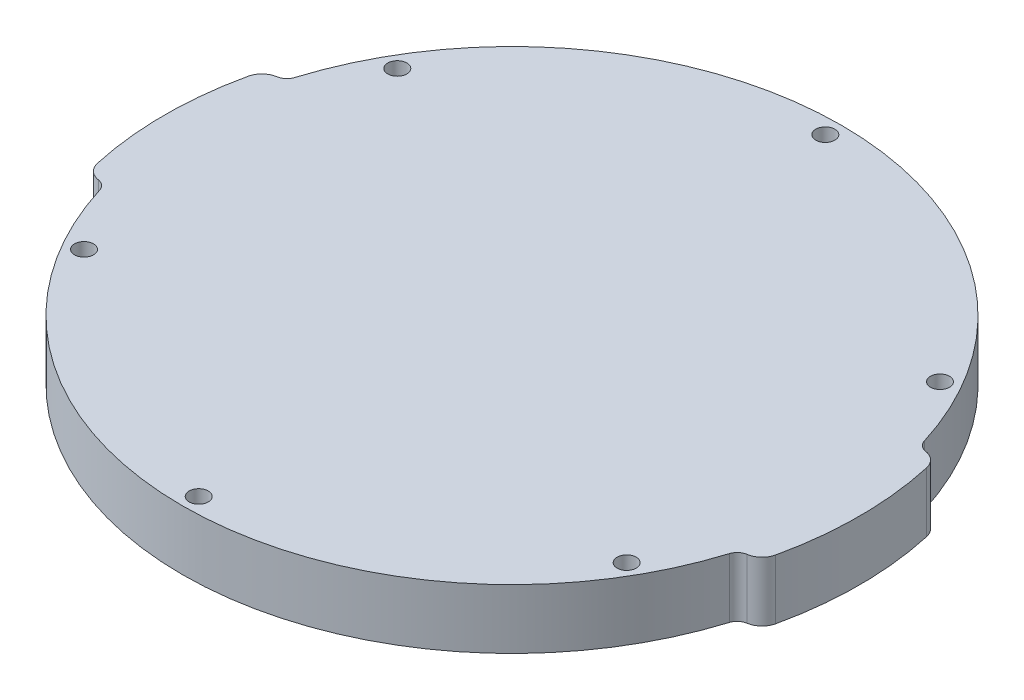
ISO-10303-21;
HEADER;
FILE_DESCRIPTION(('STEP AP214'),'2;1');
FILE_NAME('part.step','',(''),(''),'','','');
FILE_SCHEMA(('AUTOMOTIVE_DESIGN { 1 0 10303 214 1 1 1 1 }'));
ENDSEC;
DATA;
#1=APPLICATION_CONTEXT('core data for automotive mechanical design processes');
#2=APPLICATION_PROTOCOL_DEFINITION('international standard','automotive_design',2000,#1);
#3=PRODUCT_CONTEXT('',#1,'mechanical');
#4=PRODUCT('Part','Part','',(#3));
#5=PRODUCT_RELATED_PRODUCT_CATEGORY('part','',(#4));
#6=PRODUCT_DEFINITION_FORMATION('','',#4);
#7=PRODUCT_DEFINITION_CONTEXT('part definition',#1,'design');
#8=PRODUCT_DEFINITION('design','',#6,#7);
#9=PRODUCT_DEFINITION_SHAPE('','',#8);
#10=(LENGTH_UNIT() NAMED_UNIT(*) SI_UNIT(.MILLI.,.METRE.));
#11=(NAMED_UNIT(*) PLANE_ANGLE_UNIT() SI_UNIT($,.RADIAN.));
#12=(NAMED_UNIT(*) SI_UNIT($,.STERADIAN.) SOLID_ANGLE_UNIT());
#13=UNCERTAINTY_MEASURE_WITH_UNIT(LENGTH_MEASURE(1.E-05),#10,'distance_accuracy_value','');
#14=(GEOMETRIC_REPRESENTATION_CONTEXT(3) GLOBAL_UNCERTAINTY_ASSIGNED_CONTEXT((#13)) GLOBAL_UNIT_ASSIGNED_CONTEXT((#10,
#11,#12)) REPRESENTATION_CONTEXT('',''));
#15=CARTESIAN_POINT('',(0.,0.,0.));
#16=DIRECTION('',(0.,0.,1.));
#17=DIRECTION('',(1.,0.,0.));
#18=AXIS2_PLACEMENT_3D('',#15,#16,#17);
#19=CARTESIAN_POINT('',(0.,10.,0.));
#20=DIRECTION('',(0.,-1.,0.));
#21=DIRECTION('',(0.,0.,-1.));
#22=AXIS2_PLACEMENT_3D('',#19,#20,#21);
#23=CYLINDRICAL_SURFACE('',#22,55.25);
#24=CARTESIAN_POINT('',(0.,10.,0.));
#25=DIRECTION('',(0.,-1.,0.));
#26=DIRECTION('',(0.,0.,-1.));
#27=AXIS2_PLACEMENT_3D('',#24,#25,#26);
#28=CIRCLE('',#27,55.25);
#29=CARTESIAN_POINT('',(-52.7751034962949,10.,-16.3508700366483));
#30=VERTEX_POINT('',#29);
#31=CARTESIAN_POINT('',(52.7751034962949,10.,-16.3508700366483));
#32=VERTEX_POINT('',#31);
#33=EDGE_CURVE('E203',#30,#32,#28,.T.);
#34=ORIENTED_EDGE('',*,*,#33,.T.);
#35=DIRECTION('',(0.,-1.,0.));
#36=VECTOR('',#35,1.);
#37=CARTESIAN_POINT('',(52.7751034962949,10.,-16.3508700366483));
#38=LINE('',#37,#36);
#39=CARTESIAN_POINT('',(52.7751034962949,0.,-16.3508700366483));
#40=VERTEX_POINT('',#39);
#41=EDGE_CURVE('E168',#32,#40,#38,.T.);
#42=ORIENTED_EDGE('',*,*,#41,.T.);
#43=CARTESIAN_POINT('',(0.,0.,0.));
#44=DIRECTION('',(0.,1.,0.));
#45=DIRECTION('',(0.,0.,1.));
#46=AXIS2_PLACEMENT_3D('',#43,#44,#45);
#47=CIRCLE('',#46,55.25);
#48=CARTESIAN_POINT('',(-52.7751034962949,0.,-16.3508700366483));
#49=VERTEX_POINT('',#48);
#50=EDGE_CURVE('E197',#40,#49,#47,.T.);
#51=ORIENTED_EDGE('',*,*,#50,.T.);
#52=DIRECTION('',(0.,-1.,0.));
#53=VECTOR('',#52,1.);
#54=CARTESIAN_POINT('',(-52.7751034962949,10.,-16.3508700366483));
#55=LINE('',#54,#53);
#56=EDGE_CURVE('E166',#49,#30,#55,.F.);
#57=ORIENTED_EDGE('',*,*,#56,.T.);
#58=EDGE_LOOP('',(#34,#42,#51,#57));
#59=FACE_BOUND('',#58,.T.);
#60=ADVANCED_FACE('F35',(#59),#23,.T.);
#61=CARTESIAN_POINT('',(0.,10.,0.));
#62=DIRECTION('',(0.,-1.,0.));
#63=DIRECTION('',(0.,0.,-1.));
#64=AXIS2_PLACEMENT_3D('',#61,#62,#63);
#65=CYLINDRICAL_SURFACE('',#64,58.25);
#66=CARTESIAN_POINT('',(0.,0.,0.));
#67=DIRECTION('',(0.,-1.,0.));
#68=DIRECTION('',(0.,0.,-1.));
#69=AXIS2_PLACEMENT_3D('',#66,#67,#68);
#70=CIRCLE('',#69,58.25);
#71=CARTESIAN_POINT('',(-56.8594752844111,0.,12.6515837104072));
#72=VERTEX_POINT('',#71);
#73=CARTESIAN_POINT('',(-56.8594752844111,0.,-12.6515837104072));
#74=VERTEX_POINT('',#73);
#75=EDGE_CURVE('E204',#72,#74,#70,.T.);
#76=ORIENTED_EDGE('',*,*,#75,.F.);
#77=DIRECTION('',(0.,-1.,0.));
#78=VECTOR('',#77,1.);
#79=CARTESIAN_POINT('',(-56.8594752844111,10.,12.6515837104072));
#80=LINE('',#79,#78);
#81=CARTESIAN_POINT('',(-56.8594752844111,10.,12.6515837104072));
#82=VERTEX_POINT('',#81);
#83=EDGE_CURVE('E164',#72,#82,#80,.F.);
#84=ORIENTED_EDGE('',*,*,#83,.T.);
#85=CARTESIAN_POINT('',(0.,10.,0.));
#86=DIRECTION('',(0.,1.,0.));
#87=DIRECTION('',(0.,0.,1.));
#88=AXIS2_PLACEMENT_3D('',#85,#86,#87);
#89=CIRCLE('',#88,58.25);
#90=CARTESIAN_POINT('',(-56.8594752844111,10.,-12.6515837104072));
#91=VERTEX_POINT('',#90);
#92=EDGE_CURVE('E212',#91,#82,#89,.T.);
#93=ORIENTED_EDGE('',*,*,#92,.F.);
#94=DIRECTION('',(0.,-1.,0.));
#95=VECTOR('',#94,1.);
#96=CARTESIAN_POINT('',(-56.8594752844111,10.,-12.6515837104072));
#97=LINE('',#96,#95);
#98=EDGE_CURVE('E161',#91,#74,#97,.T.);
#99=ORIENTED_EDGE('',*,*,#98,.T.);
#100=EDGE_LOOP('',(#76,#84,#93,#99));
#101=FACE_BOUND('',#100,.T.);
#102=ADVANCED_FACE('F216',(#101),#65,.T.);
#103=CARTESIAN_POINT('',(0.,10.,0.));
#104=DIRECTION('',(0.,-1.,0.));
#105=DIRECTION('',(0.,0.,-1.));
#106=AXIS2_PLACEMENT_3D('',#103,#104,#105);
#107=CYLINDRICAL_SURFACE('',#106,55.25);
#108=CARTESIAN_POINT('',(0.,0.,0.));
#109=DIRECTION('',(0.,-1.,0.));
#110=DIRECTION('',(0.,0.,-1.));
#111=AXIS2_PLACEMENT_3D('',#108,#109,#110);
#112=CIRCLE('',#111,55.25);
#113=CARTESIAN_POINT('',(52.7751034962949,0.,16.3508700366483));
#114=VERTEX_POINT('',#113);
#115=CARTESIAN_POINT('',(-52.7751034962949,0.,16.3508700366484));
#116=VERTEX_POINT('',#115);
#117=EDGE_CURVE('E143',#114,#116,#112,.T.);
#118=ORIENTED_EDGE('',*,*,#117,.F.);
#119=DIRECTION('',(0.,-1.,0.));
#120=VECTOR('',#119,1.);
#121=CARTESIAN_POINT('',(52.7751034962949,10.,16.3508700366483));
#122=LINE('',#121,#120);
#123=CARTESIAN_POINT('',(52.7751034962949,10.,16.3508700366483));
#124=VERTEX_POINT('',#123);
#125=EDGE_CURVE('E179',#114,#124,#122,.F.);
#126=ORIENTED_EDGE('',*,*,#125,.T.);
#127=CARTESIAN_POINT('',(0.,10.,0.));
#128=DIRECTION('',(0.,1.,0.));
#129=DIRECTION('',(0.,0.,1.));
#130=AXIS2_PLACEMENT_3D('',#127,#128,#129);
#131=CIRCLE('',#130,55.25);
#132=CARTESIAN_POINT('',(-52.7751034962949,10.,16.3508700366484));
#133=VERTEX_POINT('',#132);
#134=EDGE_CURVE('E218',#133,#124,#131,.T.);
#135=ORIENTED_EDGE('',*,*,#134,.F.);
#136=DIRECTION('',(0.,-1.,0.));
#137=VECTOR('',#136,1.);
#138=CARTESIAN_POINT('',(-52.7751034962949,10.,16.3508700366484));
#139=LINE('',#138,#137);
#140=EDGE_CURVE('E176',#133,#116,#139,.T.);
#141=ORIENTED_EDGE('',*,*,#140,.T.);
#142=EDGE_LOOP('',(#118,#126,#135,#141));
#143=FACE_BOUND('',#142,.T.);
#144=ADVANCED_FACE('F242',(#143),#107,.T.);
#145=CARTESIAN_POINT('',(0.,10.,0.));
#146=DIRECTION('',(0.,-1.,0.));
#147=DIRECTION('',(0.,0.,-1.));
#148=AXIS2_PLACEMENT_3D('',#145,#146,#147);
#149=CYLINDRICAL_SURFACE('',#148,58.25);
#150=CARTESIAN_POINT('',(0.,0.,0.));
#151=DIRECTION('',(0.,-1.,0.));
#152=DIRECTION('',(0.,0.,-1.));
#153=AXIS2_PLACEMENT_3D('',#150,#151,#152);
#154=CIRCLE('',#153,58.25);
#155=CARTESIAN_POINT('',(56.8594752844111,0.,-12.6515837104072));
#156=VERTEX_POINT('',#155);
#157=CARTESIAN_POINT('',(56.8594752844111,0.,12.6515837104073));
#158=VERTEX_POINT('',#157);
#159=EDGE_CURVE('E128',#156,#158,#154,.T.);
#160=ORIENTED_EDGE('',*,*,#159,.F.);
#161=DIRECTION('',(0.,-1.,0.));
#162=VECTOR('',#161,1.);
#163=CARTESIAN_POINT('',(56.8594752844111,10.,-12.6515837104072));
#164=LINE('',#163,#162);
#165=CARTESIAN_POINT('',(56.8594752844111,10.,-12.6515837104072));
#166=VERTEX_POINT('',#165);
#167=EDGE_CURVE('E140',#156,#166,#164,.F.);
#168=ORIENTED_EDGE('',*,*,#167,.T.);
#169=CARTESIAN_POINT('',(0.,10.,0.));
#170=DIRECTION('',(0.,1.,0.));
#171=DIRECTION('',(0.,0.,1.));
#172=AXIS2_PLACEMENT_3D('',#169,#170,#171);
#173=CIRCLE('',#172,58.25);
#174=CARTESIAN_POINT('',(56.8594752844111,10.,12.6515837104073));
#175=VERTEX_POINT('',#174);
#176=EDGE_CURVE('E223',#175,#166,#173,.T.);
#177=ORIENTED_EDGE('',*,*,#176,.F.);
#178=DIRECTION('',(0.,-1.,0.));
#179=VECTOR('',#178,1.);
#180=CARTESIAN_POINT('',(56.8594752844111,10.,12.6515837104073));
#181=LINE('',#180,#179);
#182=EDGE_CURVE('E133',#175,#158,#181,.T.);
#183=ORIENTED_EDGE('',*,*,#182,.T.);
#184=EDGE_LOOP('',(#160,#168,#177,#183));
#185=FACE_BOUND('',#184,.T.);
#186=ADVANCED_FACE('F138',(#185),#149,.T.);
#187=CARTESIAN_POINT('',(0.,10.,0.));
#188=DIRECTION('',(0.,-1.,0.));
#189=DIRECTION('',(0.,0.,-1.));
#190=AXIS2_PLACEMENT_3D('',#187,#188,#189);
#191=PLANE('',#190);
#192=CARTESIAN_POINT('',(45.4879843337787,10.,26.2625000000019));
#193=DIRECTION('',(0.,-1.,0.));
#194=DIRECTION('',(0.,0.,-1.));
#195=AXIS2_PLACEMENT_3D('',#192,#193,#194);
#196=CIRCLE('',#195,1.60000000000064);
#197=CARTESIAN_POINT('',(45.4879843337787,10.,24.6625000000013));
#198=VERTEX_POINT('',#197);
#199=EDGE_CURVE('E359',#198,#198,#196,.T.);
#200=ORIENTED_EDGE('',*,*,#199,.T.);
#201=EDGE_LOOP('',(#200));
#202=FACE_BOUND('',#201,.T.);
#203=CARTESIAN_POINT('',(45.487984333781,10.,-26.2624999999981));
#204=DIRECTION('',(0.,-1.,0.));
#205=DIRECTION('',(0.,0.,-1.));
#206=AXIS2_PLACEMENT_3D('',#203,#204,#205);
#207=CIRCLE('',#206,1.60000000000288);
#208=CARTESIAN_POINT('',(45.487984333781,10.,-27.8625000000009));
#209=VERTEX_POINT('',#208);
#210=EDGE_CURVE('E360',#209,#209,#207,.T.);
#211=ORIENTED_EDGE('',*,*,#210,.T.);
#212=EDGE_LOOP('',(#211));
#213=FACE_BOUND('',#212,.T.);
#214=CARTESIAN_POINT('',(4.46568594887087E-12,10.,-52.525));
#215=DIRECTION('',(0.,-1.,0.));
#216=DIRECTION('',(0.,0.,-1.));
#217=AXIS2_PLACEMENT_3D('',#214,#215,#216);
#218=CIRCLE('',#217,1.60000000000462);
#219=CARTESIAN_POINT('',(4.46568594887087E-12,10.,-54.1250000000046));
#220=VERTEX_POINT('',#219);
#221=EDGE_CURVE('E366',#220,#220,#218,.T.);
#222=ORIENTED_EDGE('',*,*,#221,.T.);
#223=EDGE_LOOP('',(#222));
#224=FACE_BOUND('',#223,.T.);
#225=CARTESIAN_POINT('',(-45.4879843337743,10.,-26.262500000002));
#226=DIRECTION('',(0.,-1.,0.));
#227=DIRECTION('',(0.,0.,-1.));
#228=AXIS2_PLACEMENT_3D('',#225,#226,#227);
#229=CIRCLE('',#228,1.60000000000425);
#230=CARTESIAN_POINT('',(-45.4879843337743,10.,-27.8625000000062));
#231=VERTEX_POINT('',#230);
#232=EDGE_CURVE('E369',#231,#231,#229,.T.);
#233=ORIENTED_EDGE('',*,*,#232,.T.);
#234=EDGE_LOOP('',(#233));
#235=FACE_BOUND('',#234,.T.);
#236=CARTESIAN_POINT('',(-45.4879843337765,10.,26.262499999998));
#237=DIRECTION('',(0.,-1.,0.));
#238=DIRECTION('',(0.,0.,-1.));
#239=AXIS2_PLACEMENT_3D('',#236,#237,#238);
#240=CIRCLE('',#239,1.60000000000226);
#241=CARTESIAN_POINT('',(-45.4879843337765,10.,24.6624999999958));
#242=VERTEX_POINT('',#241);
#243=EDGE_CURVE('E309',#242,#242,#240,.T.);
#244=ORIENTED_EDGE('',*,*,#243,.T.);
#245=EDGE_LOOP('',(#244));
#246=FACE_BOUND('',#245,.T.);
#247=CARTESIAN_POINT('',(0.,10.,52.525));
#248=DIRECTION('',(0.,-1.,0.));
#249=DIRECTION('',(0.,0.,-1.));
#250=AXIS2_PLACEMENT_3D('',#247,#248,#249);
#251=CIRCLE('',#250,1.6);
#252=CARTESIAN_POINT('',(0.,10.,50.925));
#253=VERTEX_POINT('',#252);
#254=EDGE_CURVE('E144',#253,#253,#251,.T.);
#255=ORIENTED_EDGE('',*,*,#254,.T.);
#256=EDGE_LOOP('',(#255));
#257=FACE_BOUND('',#256,.T.);
#258=ORIENTED_EDGE('',*,*,#176,.T.);
#259=CARTESIAN_POINT('',(53.9310902912226,10.,-12.));
#260=DIRECTION('',(0.,-1.,0.));
#261=DIRECTION('',(0.,0.,-1.));
#262=AXIS2_PLACEMENT_3D('',#259,#260,#261);
#263=CIRCLE('',#262,3.);
#264=CARTESIAN_POINT('',(54.3837448060407,10.,-14.9656540408845));
#265=VERTEX_POINT('',#264);
#266=EDGE_CURVE('E149',#166,#265,#263,.F.);
#267=ORIENTED_EDGE('',*,*,#266,.T.);
#268=CARTESIAN_POINT('',(54.6855144825861,10.,-16.9427567348076));
#269=DIRECTION('',(0.,-1.,0.));
#270=DIRECTION('',(0.,0.,-1.));
#271=AXIS2_PLACEMENT_3D('',#268,#269,#270);
#272=CIRCLE('',#271,2.);
#273=EDGE_CURVE('E186',#265,#32,#272,.T.);
#274=ORIENTED_EDGE('',*,*,#273,.T.);
#275=ORIENTED_EDGE('',*,*,#33,.F.);
#276=CARTESIAN_POINT('',(-54.6855144825861,10.,-16.9427567348076));
#277=DIRECTION('',(0.,-1.,0.));
#278=DIRECTION('',(0.,0.,-1.));
#279=AXIS2_PLACEMENT_3D('',#276,#277,#278);
#280=CIRCLE('',#279,2.);
#281=CARTESIAN_POINT('',(-54.3837448060407,10.,-14.9656540408845));
#282=VERTEX_POINT('',#281);
#283=EDGE_CURVE('E11',#30,#282,#280,.T.);
#284=ORIENTED_EDGE('',*,*,#283,.T.);
#285=CARTESIAN_POINT('',(-53.9310902912226,10.,-12.));
#286=DIRECTION('',(0.,-1.,0.));
#287=DIRECTION('',(0.,0.,-1.));
#288=AXIS2_PLACEMENT_3D('',#285,#286,#287);
#289=CIRCLE('',#288,3.);
#290=EDGE_CURVE('E150',#282,#91,#289,.F.);
#291=ORIENTED_EDGE('',*,*,#290,.T.);
#292=ORIENTED_EDGE('',*,*,#92,.T.);
#293=CARTESIAN_POINT('',(-53.9310902912226,10.,12.));
#294=DIRECTION('',(0.,-1.,0.));
#295=DIRECTION('',(0.,0.,-1.));
#296=AXIS2_PLACEMENT_3D('',#293,#294,#295);
#297=CIRCLE('',#296,3.);
#298=CARTESIAN_POINT('',(-54.3837448060407,10.,14.9656540408845));
#299=VERTEX_POINT('',#298);
#300=EDGE_CURVE('E152',#82,#299,#297,.F.);
#301=ORIENTED_EDGE('',*,*,#300,.T.);
#302=CARTESIAN_POINT('',(-54.6855144825861,10.,16.9427567348076));
#303=DIRECTION('',(0.,-1.,0.));
#304=DIRECTION('',(0.,0.,-1.));
#305=AXIS2_PLACEMENT_3D('',#302,#303,#304);
#306=CIRCLE('',#305,2.);
#307=EDGE_CURVE('E194',#299,#133,#306,.T.);
#308=ORIENTED_EDGE('',*,*,#307,.T.);
#309=ORIENTED_EDGE('',*,*,#134,.T.);
#310=CARTESIAN_POINT('',(54.6855144825861,10.,16.9427567348076));
#311=DIRECTION('',(0.,-1.,0.));
#312=DIRECTION('',(0.,0.,-1.));
#313=AXIS2_PLACEMENT_3D('',#310,#311,#312);
#314=CIRCLE('',#313,2.);
#315=CARTESIAN_POINT('',(54.3837448060407,10.,14.9656540408845));
#316=VERTEX_POINT('',#315);
#317=EDGE_CURVE('E190',#124,#316,#314,.T.);
#318=ORIENTED_EDGE('',*,*,#317,.T.);
#319=CARTESIAN_POINT('',(53.9310902912225,10.,12.));
#320=DIRECTION('',(0.,-1.,0.));
#321=DIRECTION('',(0.,0.,-1.));
#322=AXIS2_PLACEMENT_3D('',#319,#320,#321);
#323=CIRCLE('',#322,3.);
#324=EDGE_CURVE('E158',#316,#175,#323,.F.);
#325=ORIENTED_EDGE('',*,*,#324,.T.);
#326=EDGE_LOOP('',(#258,#267,#274,#275,#284,#291,#292,#301,#308,#309,#318,#325));
#327=FACE_BOUND('',#326,.T.);
#328=ADVANCED_FACE('F211',(#202,#213,#224,#235,#246,#257,#327),#191,.F.);
#329=CARTESIAN_POINT('',(0.,0.,0.));
#330=DIRECTION('',(0.,-1.,0.));
#331=DIRECTION('',(0.,0.,-1.));
#332=AXIS2_PLACEMENT_3D('',#329,#330,#331);
#333=PLANE('',#332);
#334=CARTESIAN_POINT('',(45.4879843337787,0.,26.2625000000019));
#335=DIRECTION('',(0.,-1.,0.));
#336=DIRECTION('',(0.,0.,-1.));
#337=AXIS2_PLACEMENT_3D('',#334,#335,#336);
#338=CIRCLE('',#337,1.60000000000064);
#339=CARTESIAN_POINT('',(45.4879843337787,0.,24.6625000000013));
#340=VERTEX_POINT('',#339);
#341=EDGE_CURVE('E285',#340,#340,#338,.T.);
#342=ORIENTED_EDGE('',*,*,#341,.F.);
#343=EDGE_LOOP('',(#342));
#344=FACE_BOUND('',#343,.T.);
#345=CARTESIAN_POINT('',(45.487984333781,0.,-26.2624999999981));
#346=DIRECTION('',(0.,-1.,0.));
#347=DIRECTION('',(0.,0.,-1.));
#348=AXIS2_PLACEMENT_3D('',#345,#346,#347);
#349=CIRCLE('',#348,1.60000000000288);
#350=CARTESIAN_POINT('',(45.487984333781,0.,-27.8625000000009));
#351=VERTEX_POINT('',#350);
#352=EDGE_CURVE('E289',#351,#351,#349,.T.);
#353=ORIENTED_EDGE('',*,*,#352,.F.);
#354=EDGE_LOOP('',(#353));
#355=FACE_BOUND('',#354,.T.);
#356=CARTESIAN_POINT('',(4.46568594887087E-12,0.,-52.525));
#357=DIRECTION('',(0.,-1.,0.));
#358=DIRECTION('',(0.,0.,-1.));
#359=AXIS2_PLACEMENT_3D('',#356,#357,#358);
#360=CIRCLE('',#359,1.60000000000462);
#361=CARTESIAN_POINT('',(4.46568594887087E-12,0.,-54.1250000000046));
#362=VERTEX_POINT('',#361);
#363=EDGE_CURVE('E293',#362,#362,#360,.T.);
#364=ORIENTED_EDGE('',*,*,#363,.F.);
#365=EDGE_LOOP('',(#364));
#366=FACE_BOUND('',#365,.T.);
#367=CARTESIAN_POINT('',(-45.4879843337743,0.,-26.262500000002));
#368=DIRECTION('',(0.,-1.,0.));
#369=DIRECTION('',(0.,0.,-1.));
#370=AXIS2_PLACEMENT_3D('',#367,#368,#369);
#371=CIRCLE('',#370,1.60000000000425);
#372=CARTESIAN_POINT('',(-45.4879843337743,0.,-27.8625000000062));
#373=VERTEX_POINT('',#372);
#374=EDGE_CURVE('E297',#373,#373,#371,.T.);
#375=ORIENTED_EDGE('',*,*,#374,.F.);
#376=EDGE_LOOP('',(#375));
#377=FACE_BOUND('',#376,.T.);
#378=CARTESIAN_POINT('',(-45.4879843337765,0.,26.262499999998));
#379=DIRECTION('',(0.,-1.,0.));
#380=DIRECTION('',(0.,0.,-1.));
#381=AXIS2_PLACEMENT_3D('',#378,#379,#380);
#382=CIRCLE('',#381,1.60000000000226);
#383=CARTESIAN_POINT('',(-45.4879843337765,0.,24.6624999999958));
#384=VERTEX_POINT('',#383);
#385=EDGE_CURVE('E301',#384,#384,#382,.T.);
#386=ORIENTED_EDGE('',*,*,#385,.F.);
#387=EDGE_LOOP('',(#386));
#388=FACE_BOUND('',#387,.T.);
#389=CARTESIAN_POINT('',(0.,0.,52.525));
#390=DIRECTION('',(0.,-1.,0.));
#391=DIRECTION('',(0.,0.,-1.));
#392=AXIS2_PLACEMENT_3D('',#389,#390,#391);
#393=CIRCLE('',#392,1.6);
#394=CARTESIAN_POINT('',(0.,0.,50.925));
#395=VERTEX_POINT('',#394);
#396=EDGE_CURVE('E304',#395,#395,#393,.T.);
#397=ORIENTED_EDGE('',*,*,#396,.F.);
#398=EDGE_LOOP('',(#397));
#399=FACE_BOUND('',#398,.T.);
#400=ORIENTED_EDGE('',*,*,#50,.F.);
#401=CARTESIAN_POINT('',(54.6855144825861,0.,-16.9427567348076));
#402=DIRECTION('',(0.,-1.,0.));
#403=DIRECTION('',(0.,0.,-1.));
#404=AXIS2_PLACEMENT_3D('',#401,#402,#403);
#405=CIRCLE('',#404,2.);
#406=CARTESIAN_POINT('',(54.3837448060407,0.,-14.9656540408845));
#407=VERTEX_POINT('',#406);
#408=EDGE_CURVE('E129',#40,#407,#405,.F.);
#409=ORIENTED_EDGE('',*,*,#408,.T.);
#410=CARTESIAN_POINT('',(53.9310902912226,0.,-12.));
#411=DIRECTION('',(0.,-1.,0.));
#412=DIRECTION('',(0.,0.,-1.));
#413=AXIS2_PLACEMENT_3D('',#410,#411,#412);
#414=CIRCLE('',#413,3.);
#415=EDGE_CURVE('E123',#407,#156,#414,.T.);
#416=ORIENTED_EDGE('',*,*,#415,.T.);
#417=ORIENTED_EDGE('',*,*,#159,.T.);
#418=CARTESIAN_POINT('',(53.9310902912225,0.,12.));
#419=DIRECTION('',(0.,-1.,0.));
#420=DIRECTION('',(0.,0.,-1.));
#421=AXIS2_PLACEMENT_3D('',#418,#419,#420);
#422=CIRCLE('',#421,3.);
#423=CARTESIAN_POINT('',(54.3837448060407,0.,14.9656540408845));
#424=VERTEX_POINT('',#423);
#425=EDGE_CURVE('E134',#158,#424,#422,.T.);
#426=ORIENTED_EDGE('',*,*,#425,.T.);
#427=CARTESIAN_POINT('',(54.6855144825861,0.,16.9427567348076));
#428=DIRECTION('',(0.,-1.,0.));
#429=DIRECTION('',(0.,0.,-1.));
#430=AXIS2_PLACEMENT_3D('',#427,#428,#429);
#431=CIRCLE('',#430,2.);
#432=EDGE_CURVE('E188',#424,#114,#431,.F.);
#433=ORIENTED_EDGE('',*,*,#432,.T.);
#434=ORIENTED_EDGE('',*,*,#117,.T.);
#435=CARTESIAN_POINT('',(-54.6855144825861,0.,16.9427567348076));
#436=DIRECTION('',(0.,-1.,0.));
#437=DIRECTION('',(0.,0.,-1.));
#438=AXIS2_PLACEMENT_3D('',#435,#436,#437);
#439=CIRCLE('',#438,2.);
#440=CARTESIAN_POINT('',(-54.3837448060407,0.,14.9656540408845));
#441=VERTEX_POINT('',#440);
#442=EDGE_CURVE('E192',#116,#441,#439,.F.);
#443=ORIENTED_EDGE('',*,*,#442,.T.);
#444=CARTESIAN_POINT('',(-53.9310902912226,0.,12.));
#445=DIRECTION('',(0.,-1.,0.));
#446=DIRECTION('',(0.,0.,-1.));
#447=AXIS2_PLACEMENT_3D('',#444,#445,#446);
#448=CIRCLE('',#447,3.);
#449=EDGE_CURVE('E220',#441,#72,#448,.T.);
#450=ORIENTED_EDGE('',*,*,#449,.T.);
#451=ORIENTED_EDGE('',*,*,#75,.T.);
#452=CARTESIAN_POINT('',(-53.9310902912226,0.,-12.));
#453=DIRECTION('',(0.,-1.,0.));
#454=DIRECTION('',(0.,0.,-1.));
#455=AXIS2_PLACEMENT_3D('',#452,#453,#454);
#456=CIRCLE('',#455,3.);
#457=CARTESIAN_POINT('',(-54.3837448060407,0.,-14.9656540408845));
#458=VERTEX_POINT('',#457);
#459=EDGE_CURVE('E199',#74,#458,#456,.T.);
#460=ORIENTED_EDGE('',*,*,#459,.T.);
#461=CARTESIAN_POINT('',(-54.6855144825861,0.,-16.9427567348076));
#462=DIRECTION('',(0.,-1.,0.));
#463=DIRECTION('',(0.,0.,-1.));
#464=AXIS2_PLACEMENT_3D('',#461,#462,#463);
#465=CIRCLE('',#464,2.);
#466=EDGE_CURVE('E43',#458,#49,#465,.F.);
#467=ORIENTED_EDGE('',*,*,#466,.T.);
#468=EDGE_LOOP('',(#400,#409,#416,#417,#426,#433,#434,#443,#450,#451,#460,#467));
#469=FACE_BOUND('',#468,.T.);
#470=ADVANCED_FACE('F126',(#344,#355,#366,#377,#388,#399,#469),#333,.T.);
#471=CARTESIAN_POINT('',(53.9310902912226,10.,-12.));
#472=DIRECTION('',(0.,-1.,0.));
#473=DIRECTION('',(0.,0.,-1.));
#474=AXIS2_PLACEMENT_3D('',#471,#472,#473);
#475=CYLINDRICAL_SURFACE('',#474,3.);
#476=ORIENTED_EDGE('',*,*,#415,.F.);
#477=DIRECTION('',(0.,-1.,0.));
#478=VECTOR('',#477,1.);
#479=CARTESIAN_POINT('',(54.3837448060407,10.,-14.9656540408845));
#480=LINE('',#479,#478);
#481=EDGE_CURVE('E171',#407,#265,#480,.F.);
#482=ORIENTED_EDGE('',*,*,#481,.T.);
#483=ORIENTED_EDGE('',*,*,#266,.F.);
#484=ORIENTED_EDGE('',*,*,#167,.F.);
#485=EDGE_LOOP('',(#476,#482,#483,#484));
#486=FACE_BOUND('',#485,.T.);
#487=ADVANCED_FACE('F147',(#486),#475,.T.);
#488=CARTESIAN_POINT('',(53.9310902912225,10.,12.));
#489=DIRECTION('',(0.,-1.,0.));
#490=DIRECTION('',(0.,0.,-1.));
#491=AXIS2_PLACEMENT_3D('',#488,#489,#490);
#492=CYLINDRICAL_SURFACE('',#491,3.);
#493=ORIENTED_EDGE('',*,*,#324,.F.);
#494=DIRECTION('',(0.,-1.,0.));
#495=VECTOR('',#494,1.);
#496=CARTESIAN_POINT('',(54.3837448060407,10.,14.9656540408845));
#497=LINE('',#496,#495);
#498=EDGE_CURVE('E173',#316,#424,#497,.T.);
#499=ORIENTED_EDGE('',*,*,#498,.T.);
#500=ORIENTED_EDGE('',*,*,#425,.F.);
#501=ORIENTED_EDGE('',*,*,#182,.F.);
#502=EDGE_LOOP('',(#493,#499,#500,#501));
#503=FACE_BOUND('',#502,.T.);
#504=ADVANCED_FACE('F234',(#503),#492,.T.);
#505=CARTESIAN_POINT('',(-53.9310902912226,10.,12.));
#506=DIRECTION('',(0.,-1.,0.));
#507=DIRECTION('',(0.,0.,-1.));
#508=AXIS2_PLACEMENT_3D('',#505,#506,#507);
#509=CYLINDRICAL_SURFACE('',#508,3.);
#510=ORIENTED_EDGE('',*,*,#449,.F.);
#511=DIRECTION('',(0.,-1.,0.));
#512=VECTOR('',#511,1.);
#513=CARTESIAN_POINT('',(-54.3837448060407,10.,14.9656540408845));
#514=LINE('',#513,#512);
#515=EDGE_CURVE('E181',#441,#299,#514,.F.);
#516=ORIENTED_EDGE('',*,*,#515,.T.);
#517=ORIENTED_EDGE('',*,*,#300,.F.);
#518=ORIENTED_EDGE('',*,*,#83,.F.);
#519=EDGE_LOOP('',(#510,#516,#517,#518));
#520=FACE_BOUND('',#519,.T.);
#521=ADVANCED_FACE('F250',(#520),#509,.T.);
#522=CARTESIAN_POINT('',(-53.9310902912226,10.,-12.));
#523=DIRECTION('',(0.,-1.,0.));
#524=DIRECTION('',(0.,0.,-1.));
#525=AXIS2_PLACEMENT_3D('',#522,#523,#524);
#526=CYLINDRICAL_SURFACE('',#525,3.);
#527=ORIENTED_EDGE('',*,*,#290,.F.);
#528=DIRECTION('',(0.,-1.,0.));
#529=VECTOR('',#528,1.);
#530=CARTESIAN_POINT('',(-54.3837448060407,10.,-14.9656540408845));
#531=LINE('',#530,#529);
#532=EDGE_CURVE('E183',#282,#458,#531,.T.);
#533=ORIENTED_EDGE('',*,*,#532,.T.);
#534=ORIENTED_EDGE('',*,*,#459,.F.);
#535=ORIENTED_EDGE('',*,*,#98,.F.);
#536=EDGE_LOOP('',(#527,#533,#534,#535));
#537=FACE_BOUND('',#536,.T.);
#538=ADVANCED_FACE('F207',(#537),#526,.T.);
#539=CARTESIAN_POINT('',(54.6855144825861,10.,-16.9427567348076));
#540=DIRECTION('',(0.,1.,0.));
#541=DIRECTION('',(0.,0.,1.));
#542=AXIS2_PLACEMENT_3D('',#539,#540,#541);
#543=CYLINDRICAL_SURFACE('',#542,2.);
#544=ORIENTED_EDGE('',*,*,#273,.F.);
#545=ORIENTED_EDGE('',*,*,#481,.F.);
#546=ORIENTED_EDGE('',*,*,#408,.F.);
#547=ORIENTED_EDGE('',*,*,#41,.F.);
#548=EDGE_LOOP('',(#544,#545,#546,#547));
#549=FACE_BOUND('',#548,.T.);
#550=ADVANCED_FACE('F257',(#549),#543,.F.);
#551=CARTESIAN_POINT('',(54.6855144825861,10.,16.9427567348076));
#552=DIRECTION('',(0.,1.,0.));
#553=DIRECTION('',(0.,0.,1.));
#554=AXIS2_PLACEMENT_3D('',#551,#552,#553);
#555=CYLINDRICAL_SURFACE('',#554,2.);
#556=ORIENTED_EDGE('',*,*,#317,.F.);
#557=ORIENTED_EDGE('',*,*,#125,.F.);
#558=ORIENTED_EDGE('',*,*,#432,.F.);
#559=ORIENTED_EDGE('',*,*,#498,.F.);
#560=EDGE_LOOP('',(#556,#557,#558,#559));
#561=FACE_BOUND('',#560,.T.);
#562=ADVANCED_FACE('F238',(#561),#555,.F.);
#563=CARTESIAN_POINT('',(-54.6855144825861,10.,16.9427567348076));
#564=DIRECTION('',(0.,1.,0.));
#565=DIRECTION('',(0.,0.,1.));
#566=AXIS2_PLACEMENT_3D('',#563,#564,#565);
#567=CYLINDRICAL_SURFACE('',#566,2.);
#568=ORIENTED_EDGE('',*,*,#307,.F.);
#569=ORIENTED_EDGE('',*,*,#515,.F.);
#570=ORIENTED_EDGE('',*,*,#442,.F.);
#571=ORIENTED_EDGE('',*,*,#140,.F.);
#572=EDGE_LOOP('',(#568,#569,#570,#571));
#573=FACE_BOUND('',#572,.T.);
#574=ADVANCED_FACE('F247',(#573),#567,.F.);
#575=CARTESIAN_POINT('',(-54.6855144825861,10.,-16.9427567348076));
#576=DIRECTION('',(0.,1.,0.));
#577=DIRECTION('',(0.,0.,1.));
#578=AXIS2_PLACEMENT_3D('',#575,#576,#577);
#579=CYLINDRICAL_SURFACE('',#578,2.);
#580=ORIENTED_EDGE('',*,*,#283,.F.);
#581=ORIENTED_EDGE('',*,*,#56,.F.);
#582=ORIENTED_EDGE('',*,*,#466,.F.);
#583=ORIENTED_EDGE('',*,*,#532,.F.);
#584=EDGE_LOOP('',(#580,#581,#582,#583));
#585=FACE_BOUND('',#584,.T.);
#586=ADVANCED_FACE('F37',(#585),#579,.F.);
#587=CARTESIAN_POINT('',(0.,10.,52.525));
#588=DIRECTION('',(0.,-1.,0.));
#589=DIRECTION('',(0.,0.,-1.));
#590=AXIS2_PLACEMENT_3D('',#587,#588,#589);
#591=CYLINDRICAL_SURFACE('',#590,1.6);
#592=ORIENTED_EDGE('',*,*,#254,.F.);
#593=EDGE_LOOP('',(#592));
#594=FACE_BOUND('',#593,.T.);
#595=ORIENTED_EDGE('',*,*,#396,.T.);
#596=EDGE_LOOP('',(#595));
#597=FACE_BOUND('',#596,.T.);
#598=ADVANCED_FACE('F325',(#594,#597),#591,.F.);
#599=CARTESIAN_POINT('',(-45.4879843337765,10.,26.262499999998));
#600=DIRECTION('',(0.,-1.,0.));
#601=DIRECTION('',(0.,0.,-1.));
#602=AXIS2_PLACEMENT_3D('',#599,#600,#601);
#603=CYLINDRICAL_SURFACE('',#602,1.60000000000226);
#604=ORIENTED_EDGE('',*,*,#243,.F.);
#605=EDGE_LOOP('',(#604));
#606=FACE_BOUND('',#605,.T.);
#607=ORIENTED_EDGE('',*,*,#385,.T.);
#608=EDGE_LOOP('',(#607));
#609=FACE_BOUND('',#608,.T.);
#610=ADVANCED_FACE('F329',(#606,#609),#603,.F.);
#611=CARTESIAN_POINT('',(-45.4879843337743,10.,-26.262500000002));
#612=DIRECTION('',(0.,-1.,0.));
#613=DIRECTION('',(0.,0.,-1.));
#614=AXIS2_PLACEMENT_3D('',#611,#612,#613);
#615=CYLINDRICAL_SURFACE('',#614,1.60000000000425);
#616=ORIENTED_EDGE('',*,*,#232,.F.);
#617=EDGE_LOOP('',(#616));
#618=FACE_BOUND('',#617,.T.);
#619=ORIENTED_EDGE('',*,*,#374,.T.);
#620=EDGE_LOOP('',(#619));
#621=FACE_BOUND('',#620,.T.);
#622=ADVANCED_FACE('F335',(#618,#621),#615,.F.);
#623=CARTESIAN_POINT('',(4.46568594887087E-12,10.,-52.525));
#624=DIRECTION('',(0.,-1.,0.));
#625=DIRECTION('',(0.,0.,-1.));
#626=AXIS2_PLACEMENT_3D('',#623,#624,#625);
#627=CYLINDRICAL_SURFACE('',#626,1.60000000000462);
#628=ORIENTED_EDGE('',*,*,#221,.F.);
#629=EDGE_LOOP('',(#628));
#630=FACE_BOUND('',#629,.T.);
#631=ORIENTED_EDGE('',*,*,#363,.T.);
#632=EDGE_LOOP('',(#631));
#633=FACE_BOUND('',#632,.T.);
#634=ADVANCED_FACE('F342',(#630,#633),#627,.F.);
#635=CARTESIAN_POINT('',(45.487984333781,10.,-26.2624999999981));
#636=DIRECTION('',(0.,-1.,0.));
#637=DIRECTION('',(0.,0.,-1.));
#638=AXIS2_PLACEMENT_3D('',#635,#636,#637);
#639=CYLINDRICAL_SURFACE('',#638,1.60000000000288);
#640=ORIENTED_EDGE('',*,*,#210,.F.);
#641=EDGE_LOOP('',(#640));
#642=FACE_BOUND('',#641,.T.);
#643=ORIENTED_EDGE('',*,*,#352,.T.);
#644=EDGE_LOOP('',(#643));
#645=FACE_BOUND('',#644,.T.);
#646=ADVANCED_FACE('F346',(#642,#645),#639,.F.);
#647=CARTESIAN_POINT('',(45.4879843337787,10.,26.2625000000019));
#648=DIRECTION('',(0.,-1.,0.));
#649=DIRECTION('',(0.,0.,-1.));
#650=AXIS2_PLACEMENT_3D('',#647,#648,#649);
#651=CYLINDRICAL_SURFACE('',#650,1.60000000000064);
#652=ORIENTED_EDGE('',*,*,#199,.F.);
#653=EDGE_LOOP('',(#652));
#654=FACE_BOUND('',#653,.T.);
#655=ORIENTED_EDGE('',*,*,#341,.T.);
#656=EDGE_LOOP('',(#655));
#657=FACE_BOUND('',#656,.T.);
#658=ADVANCED_FACE('F350',(#654,#657),#651,.F.);
#659=CLOSED_SHELL('',(#60,#102,#144,#186,#328,#470,#487,#504,#521,#538,#550,#562,#574,#586,#598,
#610,#622,#634,#646,#658));
#660=MANIFOLD_SOLID_BREP('B2',#659);
#661=ADVANCED_BREP_SHAPE_REPRESENTATION('',(#18,#660),#14);
#662=SHAPE_DEFINITION_REPRESENTATION(#9,#661);
ENDSEC;
END-ISO-10303-21;
